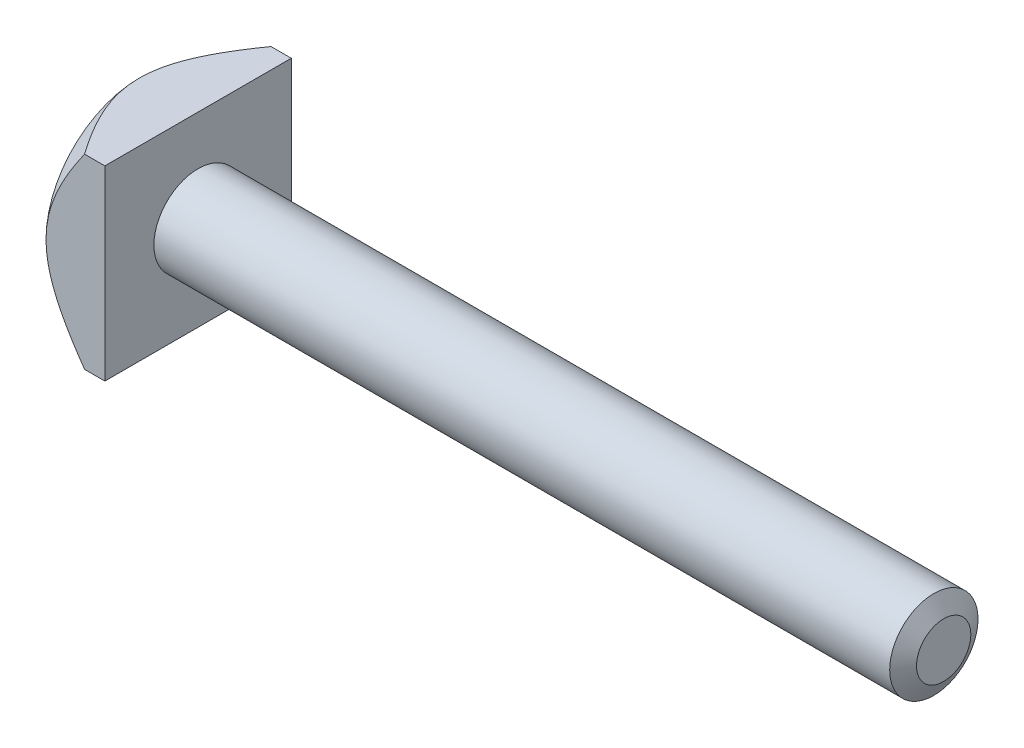
ISO-10303-21;
HEADER;
FILE_DESCRIPTION(('STEP AP214'),'2;1');
FILE_NAME('part.step','',(''),(''),'','','');
FILE_SCHEMA(('AUTOMOTIVE_DESIGN { 1 0 10303 214 1 1 1 1 }'));
ENDSEC;
DATA;
#1=APPLICATION_CONTEXT('core data for automotive mechanical design processes');
#2=APPLICATION_PROTOCOL_DEFINITION('international standard','automotive_design',2000,#1);
#3=PRODUCT_CONTEXT('',#1,'mechanical');
#4=PRODUCT('Part','Part','',(#3));
#5=PRODUCT_RELATED_PRODUCT_CATEGORY('part','',(#4));
#6=PRODUCT_DEFINITION_FORMATION('','',#4);
#7=PRODUCT_DEFINITION_CONTEXT('part definition',#1,'design');
#8=PRODUCT_DEFINITION('design','',#6,#7);
#9=PRODUCT_DEFINITION_SHAPE('','',#8);
#10=(LENGTH_UNIT() NAMED_UNIT(*) SI_UNIT(.MILLI.,.METRE.));
#11=(NAMED_UNIT(*) PLANE_ANGLE_UNIT() SI_UNIT($,.RADIAN.));
#12=(NAMED_UNIT(*) SI_UNIT($,.STERADIAN.) SOLID_ANGLE_UNIT());
#13=UNCERTAINTY_MEASURE_WITH_UNIT(LENGTH_MEASURE(1.E-05),#10,'distance_accuracy_value','');
#14=(GEOMETRIC_REPRESENTATION_CONTEXT(3) GLOBAL_UNCERTAINTY_ASSIGNED_CONTEXT((#13)) GLOBAL_UNIT_ASSIGNED_CONTEXT((#10,
#11,#12)) REPRESENTATION_CONTEXT('',''));
#15=CARTESIAN_POINT('',(0.,0.,0.));
#16=DIRECTION('',(0.,0.,1.));
#17=DIRECTION('',(1.,0.,0.));
#18=AXIS2_PLACEMENT_3D('',#15,#16,#17);
#19=CARTESIAN_POINT('',(6.,-9.5,-9.5));
#20=DIRECTION('',(0.,0.,1.));
#21=DIRECTION('',(1.,0.,0.));
#22=AXIS2_PLACEMENT_3D('',#19,#20,#21);
#23=PLANE('',#22);
#24=CARTESIAN_POINT('',(10.5397490442292,-17.6448729594658,-9.5));
#25=CARTESIAN_POINT('',(10.1740509318701,-17.2294676055011,-9.5));
#26=CARTESIAN_POINT('',(9.80991174790114,-16.8126750422406,-9.5));
#27=CARTESIAN_POINT('',(9.08559172525313,-15.9755726047441,-9.5));
#28=CARTESIAN_POINT('',(8.72541140450403,-15.5552622826643,-9.5));
#29=CARTESIAN_POINT('',(8.00801947670913,-14.7082154197354,-9.5));
#30=CARTESIAN_POINT('',(7.65083427703417,-14.2814564685435,-9.5));
#31=CARTESIAN_POINT('',(6.94271559775676,-13.4228138377135,-9.5));
#32=CARTESIAN_POINT('',(6.59178174995523,-12.9909304624125,-9.5));
#33=CARTESIAN_POINT('',(5.8743128996833,-12.0912432987366,-9.5));
#34=CARTESIAN_POINT('',(5.50833730294741,-11.6229922235265,-9.5));
#35=CARTESIAN_POINT('',(4.78836740631981,-10.6771626398532,-9.5));
#36=CARTESIAN_POINT('',(4.43437532177015,-10.1995824322098,-9.5));
#37=CARTESIAN_POINT('',(3.91621005156372,-9.47485811421282,-9.5));
#38=CARTESIAN_POINT('',(3.74580800216556,-9.23216576929913,-9.5));
#39=CARTESIAN_POINT('',(3.40990882744573,-8.74341552496572,-9.5));
#40=CARTESIAN_POINT('',(3.24441149623295,-8.4973577674554,-9.5));
#41=CARTESIAN_POINT('',(2.91929787257049,-8.00149883557695,-9.5));
#42=CARTESIAN_POINT('',(2.75967958679393,-7.75169897116564,-9.5));
#43=CARTESIAN_POINT('',(2.44743474137962,-7.24778048964867,-9.5));
#44=CARTESIAN_POINT('',(2.29480751803342,-6.99366228566542,-9.5));
#45=CARTESIAN_POINT('',(2.04522339487914,-6.56220358957074,-9.5));
#46=CARTESIAN_POINT('',(1.94600963059815,-6.38616986808012,-9.5));
#47=CARTESIAN_POINT('',(1.75206090702481,-6.03165627550383,-9.5));
#48=CARTESIAN_POINT('',(1.65732596256004,-5.85317639632244,-9.5));
#49=CARTESIAN_POINT('',(1.38070017793119,-5.31367662423799,-9.5));
#50=CARTESIAN_POINT('',(1.20643201571998,-4.94867097672205,-9.5));
#51=CARTESIAN_POINT('',(0.886108576513643,-4.21076575414403,-9.5));
#52=CARTESIAN_POINT('',(0.739784307822853,-3.83798426898276,-9.5));
#53=CARTESIAN_POINT('',(0.480763387059276,-3.08087037264878,-9.5));
#54=CARTESIAN_POINT('',(0.368046142838756,-2.69654519426552,-9.5));
#55=CARTESIAN_POINT('',(0.210747848496254,-2.03008107117148,-9.5));
#56=CARTESIAN_POINT('',(0.155893363904417,-1.75036893229043,-9.5));
#57=CARTESIAN_POINT('',(0.0698692499119896,-1.18730840218825,-9.5));
#58=CARTESIAN_POINT('',(0.0386952744121712,-0.90396068791846,-9.5));
#59=CARTESIAN_POINT('',(0.00172632293674425,-0.336061443519412,-9.5));
#60=CARTESIAN_POINT('',(-0.00411037424590556,-0.0515126652409154,-9.5));
#61=CARTESIAN_POINT('',(0.00981079382015773,0.516967754059431,-9.5));
#62=CARTESIAN_POINT('',(0.0295701744643975,0.800899357545015,-9.5));
#63=CARTESIAN_POINT('',(0.0934211464588457,1.36446402406409,-9.5));
#64=CARTESIAN_POINT('',(0.137385476267363,1.64411177293294,-9.5));
#65=CARTESIAN_POINT('',(0.247403094494964,2.19906763560613,-9.5));
#66=CARTESIAN_POINT('',(0.313462201425976,2.47437458627152,-9.5));
#67=CARTESIAN_POINT('',(0.427152134247497,2.8836854560526,-9.5));
#68=CARTESIAN_POINT('',(0.467566751486503,3.01975139817522,-9.5));
#69=CARTESIAN_POINT('',(0.552882708511166,3.290430579213,-9.5));
#70=CARTESIAN_POINT('',(0.597782724834646,3.42504423372742,-9.5));
#71=CARTESIAN_POINT('',(0.691719583446406,3.69281386852664,-9.5));
#72=CARTESIAN_POINT('',(0.740756385852614,3.82596986285051,-9.5));
#73=CARTESIAN_POINT('',(0.842628159451847,4.09082995385855,-9.5));
#74=CARTESIAN_POINT('',(0.895463521175358,4.22253389964735,-9.5));
#75=CARTESIAN_POINT('',(1.11435678587011,4.74797991836962,-9.5));
#76=CARTESIAN_POINT('',(1.29439342052333,5.13594827770292,-9.5));
#77=CARTESIAN_POINT('',(1.6781542588665,5.90003159028556,-9.5));
#78=CARTESIAN_POINT('',(1.8818929542083,6.27613911121163,-9.5));
#79=CARTESIAN_POINT('',(2.3077204819046,7.01890400837695,-9.5));
#80=CARTESIAN_POINT('',(2.52985058909013,7.38553756506628,-9.5));
#81=CARTESIAN_POINT('',(2.98774017142881,8.1100184666256,-9.5));
#82=CARTESIAN_POINT('',(3.22349676635058,8.46786764563242,-9.5));
#83=CARTESIAN_POINT('',(3.70893636287394,9.18124281183117,-9.5));
#84=CARTESIAN_POINT('',(3.9587671379424,9.5366677869467,-9.5));
#85=CARTESIAN_POINT('',(4.46696004063669,10.2413632395189,-9.5));
#86=CARTESIAN_POINT('',(4.72532251351163,10.5906334670343,-9.5));
#87=CARTESIAN_POINT('',(5.24845251639544,11.2835439956467,-9.5));
#88=CARTESIAN_POINT('',(5.51321033471839,11.6271916489512,-9.5));
#89=CARTESIAN_POINT('',(6.0481764433856,12.3101925404674,-9.5));
#90=CARTESIAN_POINT('',(6.31838457415177,12.6495459039384,-9.5));
#91=CARTESIAN_POINT('',(6.85643542198881,13.3161827975841,-9.5));
#92=CARTESIAN_POINT('',(7.12416765205754,13.6435556505652,-9.5));
#93=CARTESIAN_POINT('',(7.66316867385297,14.2953794758666,-9.5));
#94=CARTESIAN_POINT('',(7.93443750950853,14.6198304118084,-9.5));
#95=CARTESIAN_POINT('',(8.75270141640475,15.589480181523,-9.5));
#96=CARTESIAN_POINT('',(9.30412578404186,16.2309414124787,-9.5));
#97=CARTESIAN_POINT('',(10.4156274940732,17.5065643301639,-9.5));
#98=CARTESIAN_POINT('',(10.9757068909868,18.1407242193762,-9.5));
#99=CARTESIAN_POINT('',(12.1022492035901,19.4033084502766,-9.5));
#100=CARTESIAN_POINT('',(12.6687119352382,20.031732956384,-9.5));
#101=CARTESIAN_POINT('',(13.8073814418244,21.2850320273979,-9.5));
#102=CARTESIAN_POINT('',(14.3795954184628,21.9099000396876,-9.5));
#103=CARTESIAN_POINT('',(15.5278909806446,23.1560763269585,-9.5));
#104=CARTESIAN_POINT('',(16.1039725904302,23.7773845795819,-9.5));
#105=CARTESIAN_POINT('',(17.2591405695568,25.0170374371833,-9.5));
#106=CARTESIAN_POINT('',(17.8382265082941,25.6353824437012,-9.5));
#107=CARTESIAN_POINT('',(18.9989056120511,26.8697156271033,-9.5));
#108=CARTESIAN_POINT('',(19.5804987818215,27.4857037995175,-9.5));
#109=CARTESIAN_POINT('',(21.2207961007371,29.2172163496516,-9.5));
#110=CARTESIAN_POINT('',(22.2818533930034,30.3305112955609,-9.5));
#111=CARTESIAN_POINT('',(24.4088727622038,32.5524872239307,-9.5));
#112=CARTESIAN_POINT('',(25.4748350389504,33.6611680148589,-9.5));
#113=CARTESIAN_POINT('',(27.607849764915,35.8723738849253,-9.5));
#114=CARTESIAN_POINT('',(28.6748935327588,36.9749073415111,-9.5));
#115=CARTESIAN_POINT('',(30.2775176324379,38.6266560897581,-9.5));
#116=CARTESIAN_POINT('',(30.8120555521225,39.1768835757873,-9.5));
#117=CARTESIAN_POINT('',(31.881749504312,40.2767367608523,-9.5));
#118=CARTESIAN_POINT('',(32.4169055364405,40.8263624602541,-9.5));
#119=CARTESIAN_POINT('',(32.9523325814725,41.3757240614344,-9.5));
#120=B_SPLINE_CURVE_WITH_KNOTS('',3,(#24,#25,#26,#27,#28,#29,#30,#31,#32,#33,#34,#35,#36,#37,
#38,#39,#40,#41,#42,#43,#44,#45,#46,#47,#48,#49,#50,#51,#52,#53,#54,#55,#56,#57,#58,#59,#60,#61,
#62,#63,#64,#65,#66,#67,#68,#69,#70,#71,#72,#73,#74,#75,#76,#77,#78,#79,#80,#81,#82,#83,#84,#85,
#86,#87,#88,#89,#90,#91,#92,#93,#94,#95,#96,#97,#98,#99,#100,#101,#102,#103,#104,#105,#106,#107,
#108,#109,#110,#111,#112,#113,#114,#115,#116,#117,#118,#119),.UNSPECIFIED.,.F.,.F.,(4,2,2,2,2,2,
2,2,2,2,2,2,2,2,2,2,2,2,2,2,2,2,2,2,2,2,2,2,2,2,2,2,2,2,2,2,2,2,2,2,2,2,2,2,2,2,2,4),(0.,
1.66033511662324,3.32088492608776,4.99037103788057,6.65975849110603,8.44253771320777,
10.2256447302219,11.1152201121952,12.004758098373,12.8939916514495,13.7831406078993,
14.3892822557481,14.9954259101479,16.2079715914419,17.4081812091687,18.6076538998123,
19.4618901854153,20.3159696545732,21.1686422332649,22.021365296069,22.8696472572903,
23.7181527840139,24.143913273312,24.569548506671,24.9951796370199,25.4208545893226,
26.702729920288,27.9853931616287,29.2710173793666,30.5563708414144,31.8595466455747,
33.1627752496567,34.4641358357129,35.765458374762,37.0341613210163,38.3028800411185,
40.8404511025107,43.3786340754847,45.9167440549316,48.4585738777951,51.0004196476015,
53.5419106459616,56.0834064620603,60.6972117316324,65.3112066460323,69.914183829187,
72.2155590820646,74.5169329344517),.UNSPECIFIED.);
#121=CARTESIAN_POINT('',(3.93502884254439,9.5,-9.5));
#122=VERTEX_POINT('',#121);
#123=CARTESIAN_POINT('',(0.,0.,-9.5));
#124=VERTEX_POINT('',#123);
#125=EDGE_CURVE('E100',#122,#124,#120,.F.);
#126=ORIENTED_EDGE('',*,*,#125,.F.);
#127=DIRECTION('',(-1.,0.,0.));
#128=VECTOR('',#127,1.);
#129=CARTESIAN_POINT('',(6.,9.5,-9.5));
#130=LINE('',#129,#128);
#131=CARTESIAN_POINT('',(6.,9.5,-9.5));
#132=VERTEX_POINT('',#131);
#133=EDGE_CURVE('E108',#132,#122,#130,.T.);
#134=ORIENTED_EDGE('',*,*,#133,.F.);
#135=DIRECTION('',(0.,1.,0.));
#136=VECTOR('',#135,1.);
#137=CARTESIAN_POINT('',(6.,-9.5,-9.5));
#138=LINE('',#137,#136);
#139=CARTESIAN_POINT('',(6.,-9.5,-9.5));
#140=VERTEX_POINT('',#139);
#141=EDGE_CURVE('E94',#140,#132,#138,.T.);
#142=ORIENTED_EDGE('',*,*,#141,.F.);
#143=DIRECTION('',(-1.,0.,0.));
#144=VECTOR('',#143,1.);
#145=CARTESIAN_POINT('',(6.,-9.5,-9.5));
#146=LINE('',#145,#144);
#147=CARTESIAN_POINT('',(3.93502884254439,-9.5,-9.5));
#148=VERTEX_POINT('',#147);
#149=EDGE_CURVE('E190',#140,#148,#146,.T.);
#150=ORIENTED_EDGE('',*,*,#149,.T.);
#151=EDGE_CURVE('E118',#124,#148,#120,.F.);
#152=ORIENTED_EDGE('',*,*,#151,.F.);
#153=EDGE_LOOP('',(#126,#134,#142,#150,#152));
#154=FACE_BOUND('',#153,.T.);
#155=ADVANCED_FACE('F33',(#154),#23,.F.);
#156=CARTESIAN_POINT('',(6.,9.5,9.5));
#157=DIRECTION('',(0.,-1.,0.));
#158=DIRECTION('',(0.,0.,-1.));
#159=AXIS2_PLACEMENT_3D('',#156,#157,#158);
#160=PLANE('',#159);
#161=CARTESIAN_POINT('',(10.5397490442292,9.5,-17.6448729594658));
#162=CARTESIAN_POINT('',(10.1740509318701,9.5,-17.2294676055011));
#163=CARTESIAN_POINT('',(9.80991174790114,9.5,-16.8126750422406));
#164=CARTESIAN_POINT('',(9.08559172525313,9.5,-15.9755726047441));
#165=CARTESIAN_POINT('',(8.72541140450404,9.5,-15.5552622826643));
#166=CARTESIAN_POINT('',(8.00801947670913,9.5,-14.7082154197354));
#167=CARTESIAN_POINT('',(7.65083427703417,9.5,-14.2814564685435));
#168=CARTESIAN_POINT('',(6.94271559775677,9.5,-13.4228138377135));
#169=CARTESIAN_POINT('',(6.59178174995523,9.5,-12.9909304624125));
#170=CARTESIAN_POINT('',(5.8743128996833,9.5,-12.0912432987366));
#171=CARTESIAN_POINT('',(5.50833730294741,9.5,-11.6229922235265));
#172=CARTESIAN_POINT('',(4.78836740631981,9.5,-10.6771626398532));
#173=CARTESIAN_POINT('',(4.43437532177015,9.5,-10.1995824322098));
#174=CARTESIAN_POINT('',(3.91621005156372,9.5,-9.47485811421282));
#175=CARTESIAN_POINT('',(3.74580800216556,9.5,-9.23216576929913));
#176=CARTESIAN_POINT('',(3.40990882744573,9.5,-8.74341552496572));
#177=CARTESIAN_POINT('',(3.24441149623295,9.5,-8.4973577674554));
#178=CARTESIAN_POINT('',(2.91929787257049,9.5,-8.00149883557695));
#179=CARTESIAN_POINT('',(2.75967958679393,9.5,-7.75169897116564));
#180=CARTESIAN_POINT('',(2.44743474137963,9.5,-7.24778048964867));
#181=CARTESIAN_POINT('',(2.29480751803343,9.5,-6.99366228566542));
#182=CARTESIAN_POINT('',(2.04522339487915,9.5,-6.56220358957073));
#183=CARTESIAN_POINT('',(1.94600963059815,9.5,-6.38616986808012));
#184=CARTESIAN_POINT('',(1.75206090702482,9.5,-6.03165627550383));
#185=CARTESIAN_POINT('',(1.65732596256004,9.5,-5.85317639632244));
#186=CARTESIAN_POINT('',(1.38070017793119,9.5,-5.31367662423799));
#187=CARTESIAN_POINT('',(1.20643201571998,9.5,-4.94867097672205));
#188=CARTESIAN_POINT('',(0.886108576513645,9.5,-4.21076575414403));
#189=CARTESIAN_POINT('',(0.739784307822856,9.5,-3.83798426898276));
#190=CARTESIAN_POINT('',(0.480763387059279,9.5,-3.08087037264878));
#191=CARTESIAN_POINT('',(0.368046142838758,9.5,-2.69654519426552));
#192=CARTESIAN_POINT('',(0.210747848496256,9.5,-2.03008107117147));
#193=CARTESIAN_POINT('',(0.15589336390442,9.5,-1.75036893229043));
#194=CARTESIAN_POINT('',(0.0698692499119934,9.5,-1.18730840218825));
#195=CARTESIAN_POINT('',(0.0386952744121749,9.5,-0.903960687918458));
#196=CARTESIAN_POINT('',(0.00172632293674759,9.5,-0.336061443519411));
#197=CARTESIAN_POINT('',(-0.00411037424590237,9.5,-0.0515126652409146));
#198=CARTESIAN_POINT('',(0.00981079382016154,9.5,0.516967754059434));
#199=CARTESIAN_POINT('',(0.0295701744644023,9.5,0.800899357545019));
#200=CARTESIAN_POINT('',(0.0934211464588513,9.5,1.3644640240641));
#201=CARTESIAN_POINT('',(0.137385476267368,9.5,1.64411177293294));
#202=CARTESIAN_POINT('',(0.247403094494969,9.5,2.19906763560613));
#203=CARTESIAN_POINT('',(0.313462201425981,9.5,2.47437458627153));
#204=CARTESIAN_POINT('',(0.427152134247502,9.5,2.88368545605261));
#205=CARTESIAN_POINT('',(0.467566751486509,9.5,3.01975139817524));
#206=CARTESIAN_POINT('',(0.552882708511173,9.5,3.29043057921302));
#207=CARTESIAN_POINT('',(0.597782724834653,9.5,3.42504423372743));
#208=CARTESIAN_POINT('',(0.691719583446412,9.5,3.69281386852664));
#209=CARTESIAN_POINT('',(0.74075638585262,9.5,3.82596986285052));
#210=CARTESIAN_POINT('',(0.842628159451852,9.5,4.09082995385856));
#211=CARTESIAN_POINT('',(0.895463521175364,9.5,4.22253389964736));
#212=CARTESIAN_POINT('',(1.11435678587012,9.5,4.74797991836963));
#213=CARTESIAN_POINT('',(1.29439342052334,9.5,5.13594827770293));
#214=CARTESIAN_POINT('',(1.67815425886651,9.5,5.90003159028557));
#215=CARTESIAN_POINT('',(1.88189295420831,9.5,6.27613911121164));
#216=CARTESIAN_POINT('',(2.30772048190461,9.5,7.01890400837697));
#217=CARTESIAN_POINT('',(2.52985058909015,9.5,7.3855375650663));
#218=CARTESIAN_POINT('',(2.98774017142882,9.5,8.11001846662563));
#219=CARTESIAN_POINT('',(3.2234967663506,9.5,8.46786764563244));
#220=CARTESIAN_POINT('',(3.70893636287396,9.5,9.1812428118312));
#221=CARTESIAN_POINT('',(3.95876713794242,9.5,9.53666778694673));
#222=CARTESIAN_POINT('',(4.46696004063671,9.5,10.2413632395189));
#223=CARTESIAN_POINT('',(4.72532251351166,9.5,10.5906334670343));
#224=CARTESIAN_POINT('',(5.24845251639546,9.5,11.2835439956468));
#225=CARTESIAN_POINT('',(5.51321033471841,9.5,11.6271916489512));
#226=CARTESIAN_POINT('',(6.04817644338563,9.5,12.3101925404674));
#227=CARTESIAN_POINT('',(6.3183845741518,9.5,12.6495459039384));
#228=CARTESIAN_POINT('',(6.85643542198884,9.5,13.3161827975841));
#229=CARTESIAN_POINT('',(7.12416765205757,9.5,13.6435556505652));
#230=CARTESIAN_POINT('',(7.663168673853,9.5,14.2953794758666));
#231=CARTESIAN_POINT('',(7.93443750950856,9.5,14.6198304118084));
#232=CARTESIAN_POINT('',(8.75270141640478,9.5,15.589480181523));
#233=CARTESIAN_POINT('',(9.30412578404189,9.5,16.2309414124787));
#234=CARTESIAN_POINT('',(10.4156274940732,9.5,17.5065643301639));
#235=CARTESIAN_POINT('',(10.9757068909868,9.5,18.1407242193763));
#236=CARTESIAN_POINT('',(12.1022492035901,9.5,19.4033084502766));
#237=CARTESIAN_POINT('',(12.6687119352383,9.5,20.031732956384));
#238=CARTESIAN_POINT('',(13.8073814418244,9.5,21.2850320273979));
#239=CARTESIAN_POINT('',(14.3795954184628,9.5,21.9099000396876));
#240=CARTESIAN_POINT('',(15.5278909806446,9.5,23.1560763269585));
#241=CARTESIAN_POINT('',(16.1039725904302,9.5,23.7773845795819));
#242=CARTESIAN_POINT('',(17.2591405695568,9.5,25.0170374371833));
#243=CARTESIAN_POINT('',(17.8382265082941,9.5,25.6353824437013));
#244=CARTESIAN_POINT('',(18.9989056120512,9.5,26.8697156271033));
#245=CARTESIAN_POINT('',(19.5804987818216,9.5,27.4857037995175));
#246=CARTESIAN_POINT('',(21.2207961007371,9.5,29.2172163496516));
#247=CARTESIAN_POINT('',(22.2818533930034,9.5,30.3305112955609));
#248=CARTESIAN_POINT('',(24.4088727622038,9.5,32.5524872239307));
#249=CARTESIAN_POINT('',(25.4748350389504,9.5,33.661168014859));
#250=CARTESIAN_POINT('',(27.607849764915,9.5,35.8723738849254));
#251=CARTESIAN_POINT('',(28.6748935327588,9.5,36.9749073415111));
#252=CARTESIAN_POINT('',(30.277517632438,9.5,38.6266560897582));
#253=CARTESIAN_POINT('',(30.8120555521225,9.5,39.1768835757873));
#254=CARTESIAN_POINT('',(31.881749504312,9.5,40.2767367608523));
#255=CARTESIAN_POINT('',(32.4169055364406,9.5,40.8263624602542));
#256=CARTESIAN_POINT('',(32.9523325814725,9.5,41.3757240614344));
#257=B_SPLINE_CURVE_WITH_KNOTS('',3,(#161,#162,#163,#164,#165,#166,#167,#168,#169,#170,#171,
#172,#173,#174,#175,#176,#177,#178,#179,#180,#181,#182,#183,#184,#185,#186,#187,#188,#189,#190,
#191,#192,#193,#194,#195,#196,#197,#198,#199,#200,#201,#202,#203,#204,#205,#206,#207,#208,#209,
#210,#211,#212,#213,#214,#215,#216,#217,#218,#219,#220,#221,#222,#223,#224,#225,#226,#227,#228,
#229,#230,#231,#232,#233,#234,#235,#236,#237,#238,#239,#240,#241,#242,#243,#244,#245,#246,#247,
#248,#249,#250,#251,#252,#253,#254,#255,#256),.UNSPECIFIED.,.F.,.F.,(4,2,2,2,2,2,2,2,2,2,2,2,2,
2,2,2,2,2,2,2,2,2,2,2,2,2,2,2,2,2,2,2,2,2,2,2,2,2,2,2,2,2,2,2,2,2,2,4),(0.,1.66033511662324,
3.32088492608776,4.99037103788057,6.65975849110603,8.44253771320777,10.2256447302219,
11.1152201121952,12.004758098373,12.8939916514495,13.7831406078993,14.3892822557481,
14.9954259101479,16.2079715914419,17.4081812091687,18.6076538998123,19.4618901854153,
20.3159696545732,21.1686422332649,22.021365296069,22.8696472572903,23.7181527840139,
24.143913273312,24.569548506671,24.9951796370199,25.4208545893227,26.702729920288,
27.9853931616288,29.2710173793666,30.5563708414144,31.8595466455748,33.1627752496568,
34.464135835713,35.7654583747621,37.0341613210164,38.3028800411185,40.8404511025107,
43.3786340754848,45.9167440549317,48.4585738777952,51.0004196476015,53.5419106459616,
56.0834064620603,60.6972117316325,65.3112066460324,69.914183829187,72.2155590820647,
74.5169329344518),.UNSPECIFIED.);
#258=CARTESIAN_POINT('',(3.93502884254439,9.5,9.5));
#259=VERTEX_POINT('',#258);
#260=CARTESIAN_POINT('',(0.,9.5,0.));
#261=VERTEX_POINT('',#260);
#262=EDGE_CURVE('E85',#259,#261,#257,.F.);
#263=ORIENTED_EDGE('',*,*,#262,.F.);
#264=DIRECTION('',(-1.,0.,0.));
#265=VECTOR('',#264,1.);
#266=CARTESIAN_POINT('',(6.,9.5,9.5));
#267=LINE('',#266,#265);
#268=CARTESIAN_POINT('',(6.,9.5,9.5));
#269=VERTEX_POINT('',#268);
#270=EDGE_CURVE('E185',#269,#259,#267,.T.);
#271=ORIENTED_EDGE('',*,*,#270,.F.);
#272=DIRECTION('',(0.,0.,1.));
#273=VECTOR('',#272,1.);
#274=CARTESIAN_POINT('',(6.,9.5,9.5));
#275=LINE('',#274,#273);
#276=EDGE_CURVE('E195',#132,#269,#275,.T.);
#277=ORIENTED_EDGE('',*,*,#276,.F.);
#278=ORIENTED_EDGE('',*,*,#133,.T.);
#279=EDGE_CURVE('E95',#261,#122,#257,.F.);
#280=ORIENTED_EDGE('',*,*,#279,.F.);
#281=EDGE_LOOP('',(#263,#271,#277,#278,#280));
#282=FACE_BOUND('',#281,.T.);
#283=ADVANCED_FACE('F106',(#282),#160,.F.);
#284=CARTESIAN_POINT('',(6.,-9.5,9.5));
#285=DIRECTION('',(0.,0.,-1.));
#286=DIRECTION('',(-1.,0.,0.));
#287=AXIS2_PLACEMENT_3D('',#284,#285,#286);
#288=PLANE('',#287);
#289=CARTESIAN_POINT('',(10.5397490442292,-17.6448729594658,9.5));
#290=CARTESIAN_POINT('',(10.1740509318701,-17.2294676055011,9.5));
#291=CARTESIAN_POINT('',(9.80991174790114,-16.8126750422406,9.5));
#292=CARTESIAN_POINT('',(9.08559172525313,-15.9755726047441,9.5));
#293=CARTESIAN_POINT('',(8.72541140450404,-15.5552622826643,9.5));
#294=CARTESIAN_POINT('',(8.00801947670913,-14.7082154197354,9.5));
#295=CARTESIAN_POINT('',(7.65083427703417,-14.2814564685435,9.5));
#296=CARTESIAN_POINT('',(6.94271559775677,-13.4228138377135,9.5));
#297=CARTESIAN_POINT('',(6.59178174995523,-12.9909304624125,9.5));
#298=CARTESIAN_POINT('',(5.8743128996833,-12.0912432987366,9.5));
#299=CARTESIAN_POINT('',(5.50833730294741,-11.6229922235265,9.5));
#300=CARTESIAN_POINT('',(4.78836740631981,-10.6771626398532,9.5));
#301=CARTESIAN_POINT('',(4.43437532177015,-10.1995824322098,9.5));
#302=CARTESIAN_POINT('',(3.91621005156372,-9.47485811421282,9.5));
#303=CARTESIAN_POINT('',(3.74580800216556,-9.23216576929913,9.5));
#304=CARTESIAN_POINT('',(3.40990882744573,-8.74341552496572,9.5));
#305=CARTESIAN_POINT('',(3.24441149623295,-8.4973577674554,9.5));
#306=CARTESIAN_POINT('',(2.91929787257049,-8.00149883557695,9.5));
#307=CARTESIAN_POINT('',(2.75967958679393,-7.75169897116564,9.5));
#308=CARTESIAN_POINT('',(2.44743474137963,-7.24778048964867,9.5));
#309=CARTESIAN_POINT('',(2.29480751803343,-6.99366228566542,9.5));
#310=CARTESIAN_POINT('',(2.04522339487915,-6.56220358957073,9.5));
#311=CARTESIAN_POINT('',(1.94600963059815,-6.38616986808012,9.5));
#312=CARTESIAN_POINT('',(1.75206090702482,-6.03165627550383,9.5));
#313=CARTESIAN_POINT('',(1.65732596256004,-5.85317639632244,9.5));
#314=CARTESIAN_POINT('',(1.38070017793119,-5.31367662423799,9.5));
#315=CARTESIAN_POINT('',(1.20643201571998,-4.94867097672205,9.5));
#316=CARTESIAN_POINT('',(0.886108576513645,-4.21076575414403,9.5));
#317=CARTESIAN_POINT('',(0.739784307822856,-3.83798426898276,9.5));
#318=CARTESIAN_POINT('',(0.480763387059279,-3.08087037264878,9.5));
#319=CARTESIAN_POINT('',(0.368046142838758,-2.69654519426552,9.5));
#320=CARTESIAN_POINT('',(0.210747848496256,-2.03008107117147,9.5));
#321=CARTESIAN_POINT('',(0.15589336390442,-1.75036893229043,9.5));
#322=CARTESIAN_POINT('',(0.0698692499119934,-1.18730840218825,9.5));
#323=CARTESIAN_POINT('',(0.0386952744121749,-0.903960687918458,9.5));
#324=CARTESIAN_POINT('',(0.00172632293674759,-0.336061443519411,9.5));
#325=CARTESIAN_POINT('',(-0.00411037424590237,-0.0515126652409146,9.5));
#326=CARTESIAN_POINT('',(0.00981079382016154,0.516967754059434,9.5));
#327=CARTESIAN_POINT('',(0.0295701744644023,0.800899357545019,9.5));
#328=CARTESIAN_POINT('',(0.0934211464588513,1.3644640240641,9.5));
#329=CARTESIAN_POINT('',(0.137385476267368,1.64411177293294,9.5));
#330=CARTESIAN_POINT('',(0.247403094494969,2.19906763560613,9.5));
#331=CARTESIAN_POINT('',(0.313462201425981,2.47437458627153,9.5));
#332=CARTESIAN_POINT('',(0.427152134247502,2.88368545605261,9.5));
#333=CARTESIAN_POINT('',(0.467566751486509,3.01975139817524,9.5));
#334=CARTESIAN_POINT('',(0.552882708511173,3.29043057921302,9.5));
#335=CARTESIAN_POINT('',(0.597782724834653,3.42504423372743,9.5));
#336=CARTESIAN_POINT('',(0.691719583446412,3.69281386852664,9.5));
#337=CARTESIAN_POINT('',(0.74075638585262,3.82596986285052,9.5));
#338=CARTESIAN_POINT('',(0.842628159451852,4.09082995385856,9.5));
#339=CARTESIAN_POINT('',(0.895463521175364,4.22253389964736,9.5));
#340=CARTESIAN_POINT('',(1.11435678587012,4.74797991836963,9.5));
#341=CARTESIAN_POINT('',(1.29439342052334,5.13594827770293,9.5));
#342=CARTESIAN_POINT('',(1.67815425886651,5.90003159028557,9.5));
#343=CARTESIAN_POINT('',(1.88189295420831,6.27613911121164,9.5));
#344=CARTESIAN_POINT('',(2.30772048190461,7.01890400837697,9.5));
#345=CARTESIAN_POINT('',(2.52985058909015,7.3855375650663,9.5));
#346=CARTESIAN_POINT('',(2.98774017142882,8.11001846662563,9.5));
#347=CARTESIAN_POINT('',(3.2234967663506,8.46786764563244,9.5));
#348=CARTESIAN_POINT('',(3.70893636287396,9.1812428118312,9.5));
#349=CARTESIAN_POINT('',(3.95876713794242,9.53666778694673,9.5));
#350=CARTESIAN_POINT('',(4.46696004063671,10.2413632395189,9.5));
#351=CARTESIAN_POINT('',(4.72532251351166,10.5906334670343,9.5));
#352=CARTESIAN_POINT('',(5.24845251639546,11.2835439956468,9.5));
#353=CARTESIAN_POINT('',(5.51321033471841,11.6271916489512,9.5));
#354=CARTESIAN_POINT('',(6.04817644338563,12.3101925404674,9.5));
#355=CARTESIAN_POINT('',(6.3183845741518,12.6495459039384,9.5));
#356=CARTESIAN_POINT('',(6.85643542198884,13.3161827975841,9.5));
#357=CARTESIAN_POINT('',(7.12416765205757,13.6435556505652,9.5));
#358=CARTESIAN_POINT('',(7.663168673853,14.2953794758666,9.5));
#359=CARTESIAN_POINT('',(7.93443750950856,14.6198304118084,9.5));
#360=CARTESIAN_POINT('',(8.75270141640478,15.589480181523,9.5));
#361=CARTESIAN_POINT('',(9.30412578404189,16.2309414124787,9.5));
#362=CARTESIAN_POINT('',(10.4156274940732,17.5065643301639,9.5));
#363=CARTESIAN_POINT('',(10.9757068909868,18.1407242193763,9.5));
#364=CARTESIAN_POINT('',(12.1022492035901,19.4033084502766,9.5));
#365=CARTESIAN_POINT('',(12.6687119352383,20.031732956384,9.5));
#366=CARTESIAN_POINT('',(13.8073814418244,21.2850320273979,9.5));
#367=CARTESIAN_POINT('',(14.3795954184628,21.9099000396876,9.5));
#368=CARTESIAN_POINT('',(15.5278909806446,23.1560763269585,9.5));
#369=CARTESIAN_POINT('',(16.1039725904302,23.7773845795819,9.5));
#370=CARTESIAN_POINT('',(17.2591405695568,25.0170374371833,9.5));
#371=CARTESIAN_POINT('',(17.8382265082941,25.6353824437013,9.5));
#372=CARTESIAN_POINT('',(18.9989056120512,26.8697156271033,9.5));
#373=CARTESIAN_POINT('',(19.5804987818216,27.4857037995175,9.5));
#374=CARTESIAN_POINT('',(21.2207961007371,29.2172163496516,9.5));
#375=CARTESIAN_POINT('',(22.2818533930034,30.3305112955609,9.5));
#376=CARTESIAN_POINT('',(24.4088727622038,32.5524872239307,9.5));
#377=CARTESIAN_POINT('',(25.4748350389504,33.661168014859,9.5));
#378=CARTESIAN_POINT('',(27.607849764915,35.8723738849254,9.5));
#379=CARTESIAN_POINT('',(28.6748935327588,36.9749073415111,9.5));
#380=CARTESIAN_POINT('',(30.277517632438,38.6266560897582,9.5));
#381=CARTESIAN_POINT('',(30.8120555521225,39.1768835757873,9.5));
#382=CARTESIAN_POINT('',(31.881749504312,40.2767367608523,9.5));
#383=CARTESIAN_POINT('',(32.4169055364406,40.8263624602542,9.5));
#384=CARTESIAN_POINT('',(32.9523325814725,41.3757240614344,9.5));
#385=B_SPLINE_CURVE_WITH_KNOTS('',3,(#289,#290,#291,#292,#293,#294,#295,#296,#297,#298,#299,
#300,#301,#302,#303,#304,#305,#306,#307,#308,#309,#310,#311,#312,#313,#314,#315,#316,#317,#318,
#319,#320,#321,#322,#323,#324,#325,#326,#327,#328,#329,#330,#331,#332,#333,#334,#335,#336,#337,
#338,#339,#340,#341,#342,#343,#344,#345,#346,#347,#348,#349,#350,#351,#352,#353,#354,#355,#356,
#357,#358,#359,#360,#361,#362,#363,#364,#365,#366,#367,#368,#369,#370,#371,#372,#373,#374,#375,
#376,#377,#378,#379,#380,#381,#382,#383,#384),.UNSPECIFIED.,.F.,.F.,(4,2,2,2,2,2,2,2,2,2,2,2,2,
2,2,2,2,2,2,2,2,2,2,2,2,2,2,2,2,2,2,2,2,2,2,2,2,2,2,2,2,2,2,2,2,2,2,4),(0.,1.66033511662324,
3.32088492608776,4.99037103788057,6.65975849110603,8.44253771320777,10.2256447302219,
11.1152201121952,12.004758098373,12.8939916514495,13.7831406078993,14.3892822557481,
14.9954259101479,16.2079715914419,17.4081812091687,18.6076538998123,19.4618901854153,
20.3159696545732,21.1686422332649,22.021365296069,22.8696472572903,23.7181527840139,
24.143913273312,24.569548506671,24.9951796370199,25.4208545893227,26.702729920288,
27.9853931616288,29.2710173793666,30.5563708414144,31.8595466455748,33.1627752496568,
34.464135835713,35.7654583747621,37.0341613210164,38.3028800411185,40.8404511025107,
43.3786340754848,45.9167440549317,48.4585738777952,51.0004196476015,53.5419106459616,
56.0834064620603,60.6972117316325,65.3112066460324,69.914183829187,72.2155590820647,
74.5169329344518),.UNSPECIFIED.);
#386=CARTESIAN_POINT('',(3.93502884254439,-9.5,9.5));
#387=VERTEX_POINT('',#386);
#388=CARTESIAN_POINT('',(0.,0.,9.5));
#389=VERTEX_POINT('',#388);
#390=EDGE_CURVE('E110',#387,#389,#385,.T.);
#391=ORIENTED_EDGE('',*,*,#390,.F.);
#392=DIRECTION('',(-1.,0.,0.));
#393=VECTOR('',#392,1.);
#394=CARTESIAN_POINT('',(6.,-9.5,9.5));
#395=LINE('',#394,#393);
#396=CARTESIAN_POINT('',(6.,-9.5,9.5));
#397=VERTEX_POINT('',#396);
#398=EDGE_CURVE('E187',#397,#387,#395,.T.);
#399=ORIENTED_EDGE('',*,*,#398,.F.);
#400=DIRECTION('',(0.,-1.,0.));
#401=VECTOR('',#400,1.);
#402=CARTESIAN_POINT('',(6.,-9.5,9.5));
#403=LINE('',#402,#401);
#404=EDGE_CURVE('E194',#269,#397,#403,.T.);
#405=ORIENTED_EDGE('',*,*,#404,.F.);
#406=ORIENTED_EDGE('',*,*,#270,.T.);
#407=EDGE_CURVE('E89',#389,#259,#385,.T.);
#408=ORIENTED_EDGE('',*,*,#407,.F.);
#409=EDGE_LOOP('',(#391,#399,#405,#406,#408));
#410=FACE_BOUND('',#409,.T.);
#411=ADVANCED_FACE('F128',(#410),#288,.F.);
#412=CARTESIAN_POINT('',(6.,-9.5,9.5));
#413=DIRECTION('',(0.,1.,0.));
#414=DIRECTION('',(0.,0.,1.));
#415=AXIS2_PLACEMENT_3D('',#412,#413,#414);
#416=PLANE('',#415);
#417=CARTESIAN_POINT('',(10.5397490442292,-9.5,-17.6448729594658));
#418=CARTESIAN_POINT('',(10.1740509318701,-9.5,-17.2294676055011));
#419=CARTESIAN_POINT('',(9.80991174790114,-9.5,-16.8126750422406));
#420=CARTESIAN_POINT('',(9.08559172525313,-9.5,-15.9755726047441));
#421=CARTESIAN_POINT('',(8.72541140450403,-9.5,-15.5552622826643));
#422=CARTESIAN_POINT('',(8.00801947670913,-9.5,-14.7082154197354));
#423=CARTESIAN_POINT('',(7.65083427703417,-9.5,-14.2814564685435));
#424=CARTESIAN_POINT('',(6.94271559775676,-9.5,-13.4228138377135));
#425=CARTESIAN_POINT('',(6.59178174995523,-9.5,-12.9909304624125));
#426=CARTESIAN_POINT('',(5.8743128996833,-9.5,-12.0912432987366));
#427=CARTESIAN_POINT('',(5.50833730294741,-9.5,-11.6229922235265));
#428=CARTESIAN_POINT('',(4.78836740631981,-9.5,-10.6771626398532));
#429=CARTESIAN_POINT('',(4.43437532177015,-9.5,-10.1995824322098));
#430=CARTESIAN_POINT('',(3.91621005156372,-9.5,-9.47485811421282));
#431=CARTESIAN_POINT('',(3.74580800216556,-9.5,-9.23216576929913));
#432=CARTESIAN_POINT('',(3.40990882744573,-9.5,-8.74341552496572));
#433=CARTESIAN_POINT('',(3.24441149623295,-9.5,-8.4973577674554));
#434=CARTESIAN_POINT('',(2.91929787257049,-9.5,-8.00149883557695));
#435=CARTESIAN_POINT('',(2.75967958679393,-9.5,-7.75169897116564));
#436=CARTESIAN_POINT('',(2.44743474137962,-9.5,-7.24778048964867));
#437=CARTESIAN_POINT('',(2.29480751803342,-9.5,-6.99366228566542));
#438=CARTESIAN_POINT('',(2.04522339487914,-9.5,-6.56220358957074));
#439=CARTESIAN_POINT('',(1.94600963059815,-9.5,-6.38616986808012));
#440=CARTESIAN_POINT('',(1.75206090702481,-9.5,-6.03165627550383));
#441=CARTESIAN_POINT('',(1.65732596256004,-9.5,-5.85317639632244));
#442=CARTESIAN_POINT('',(1.38070017793119,-9.5,-5.31367662423799));
#443=CARTESIAN_POINT('',(1.20643201571998,-9.5,-4.94867097672205));
#444=CARTESIAN_POINT('',(0.886108576513643,-9.5,-4.21076575414403));
#445=CARTESIAN_POINT('',(0.739784307822853,-9.5,-3.83798426898276));
#446=CARTESIAN_POINT('',(0.480763387059276,-9.5,-3.08087037264878));
#447=CARTESIAN_POINT('',(0.368046142838756,-9.5,-2.69654519426552));
#448=CARTESIAN_POINT('',(0.210747848496254,-9.5,-2.03008107117148));
#449=CARTESIAN_POINT('',(0.155893363904417,-9.5,-1.75036893229043));
#450=CARTESIAN_POINT('',(0.0698692499119896,-9.5,-1.18730840218825));
#451=CARTESIAN_POINT('',(0.0386952744121712,-9.5,-0.90396068791846));
#452=CARTESIAN_POINT('',(0.00172632293674425,-9.5,-0.336061443519412));
#453=CARTESIAN_POINT('',(-0.00411037424590556,-9.5,-0.0515126652409154));
#454=CARTESIAN_POINT('',(0.00981079382015773,-9.5,0.516967754059431));
#455=CARTESIAN_POINT('',(0.0295701744643975,-9.5,0.800899357545015));
#456=CARTESIAN_POINT('',(0.0934211464588457,-9.5,1.36446402406409));
#457=CARTESIAN_POINT('',(0.137385476267363,-9.5,1.64411177293294));
#458=CARTESIAN_POINT('',(0.247403094494964,-9.5,2.19906763560613));
#459=CARTESIAN_POINT('',(0.313462201425976,-9.5,2.47437458627152));
#460=CARTESIAN_POINT('',(0.427152134247497,-9.5,2.8836854560526));
#461=CARTESIAN_POINT('',(0.467566751486503,-9.5,3.01975139817522));
#462=CARTESIAN_POINT('',(0.552882708511166,-9.5,3.290430579213));
#463=CARTESIAN_POINT('',(0.597782724834646,-9.5,3.42504423372742));
#464=CARTESIAN_POINT('',(0.691719583446406,-9.5,3.69281386852664));
#465=CARTESIAN_POINT('',(0.740756385852614,-9.5,3.82596986285051));
#466=CARTESIAN_POINT('',(0.842628159451847,-9.5,4.09082995385855));
#467=CARTESIAN_POINT('',(0.895463521175358,-9.5,4.22253389964735));
#468=CARTESIAN_POINT('',(1.11435678587011,-9.5,4.74797991836962));
#469=CARTESIAN_POINT('',(1.29439342052333,-9.5,5.13594827770292));
#470=CARTESIAN_POINT('',(1.6781542588665,-9.5,5.90003159028556));
#471=CARTESIAN_POINT('',(1.8818929542083,-9.5,6.27613911121163));
#472=CARTESIAN_POINT('',(2.3077204819046,-9.5,7.01890400837695));
#473=CARTESIAN_POINT('',(2.52985058909013,-9.5,7.38553756506628));
#474=CARTESIAN_POINT('',(2.98774017142881,-9.5,8.1100184666256));
#475=CARTESIAN_POINT('',(3.22349676635058,-9.5,8.46786764563242));
#476=CARTESIAN_POINT('',(3.70893636287394,-9.5,9.18124281183117));
#477=CARTESIAN_POINT('',(3.9587671379424,-9.5,9.5366677869467));
#478=CARTESIAN_POINT('',(4.46696004063669,-9.5,10.2413632395189));
#479=CARTESIAN_POINT('',(4.72532251351163,-9.5,10.5906334670343));
#480=CARTESIAN_POINT('',(5.24845251639544,-9.5,11.2835439956467));
#481=CARTESIAN_POINT('',(5.51321033471839,-9.5,11.6271916489512));
#482=CARTESIAN_POINT('',(6.0481764433856,-9.5,12.3101925404674));
#483=CARTESIAN_POINT('',(6.31838457415177,-9.5,12.6495459039384));
#484=CARTESIAN_POINT('',(6.85643542198881,-9.5,13.3161827975841));
#485=CARTESIAN_POINT('',(7.12416765205754,-9.5,13.6435556505652));
#486=CARTESIAN_POINT('',(7.66316867385297,-9.5,14.2953794758666));
#487=CARTESIAN_POINT('',(7.93443750950853,-9.5,14.6198304118084));
#488=CARTESIAN_POINT('',(8.75270141640475,-9.5,15.589480181523));
#489=CARTESIAN_POINT('',(9.30412578404186,-9.5,16.2309414124787));
#490=CARTESIAN_POINT('',(10.4156274940732,-9.5,17.5065643301639));
#491=CARTESIAN_POINT('',(10.9757068909868,-9.5,18.1407242193762));
#492=CARTESIAN_POINT('',(12.1022492035901,-9.5,19.4033084502766));
#493=CARTESIAN_POINT('',(12.6687119352382,-9.5,20.031732956384));
#494=CARTESIAN_POINT('',(13.8073814418244,-9.5,21.2850320273979));
#495=CARTESIAN_POINT('',(14.3795954184628,-9.5,21.9099000396876));
#496=CARTESIAN_POINT('',(15.5278909806446,-9.5,23.1560763269585));
#497=CARTESIAN_POINT('',(16.1039725904302,-9.5,23.7773845795819));
#498=CARTESIAN_POINT('',(17.2591405695568,-9.5,25.0170374371833));
#499=CARTESIAN_POINT('',(17.8382265082941,-9.5,25.6353824437012));
#500=CARTESIAN_POINT('',(18.9989056120511,-9.5,26.8697156271033));
#501=CARTESIAN_POINT('',(19.5804987818215,-9.5,27.4857037995175));
#502=CARTESIAN_POINT('',(21.2207961007371,-9.5,29.2172163496516));
#503=CARTESIAN_POINT('',(22.2818533930034,-9.5,30.3305112955609));
#504=CARTESIAN_POINT('',(24.4088727622038,-9.5,32.5524872239307));
#505=CARTESIAN_POINT('',(25.4748350389504,-9.5,33.6611680148589));
#506=CARTESIAN_POINT('',(27.607849764915,-9.5,35.8723738849253));
#507=CARTESIAN_POINT('',(28.6748935327588,-9.5,36.9749073415111));
#508=CARTESIAN_POINT('',(30.2775176324379,-9.5,38.6266560897581));
#509=CARTESIAN_POINT('',(30.8120555521225,-9.5,39.1768835757873));
#510=CARTESIAN_POINT('',(31.881749504312,-9.5,40.2767367608523));
#511=CARTESIAN_POINT('',(32.4169055364405,-9.5,40.8263624602541));
#512=CARTESIAN_POINT('',(32.9523325814725,-9.5,41.3757240614344));
#513=B_SPLINE_CURVE_WITH_KNOTS('',3,(#417,#418,#419,#420,#421,#422,#423,#424,#425,#426,#427,
#428,#429,#430,#431,#432,#433,#434,#435,#436,#437,#438,#439,#440,#441,#442,#443,#444,#445,#446,
#447,#448,#449,#450,#451,#452,#453,#454,#455,#456,#457,#458,#459,#460,#461,#462,#463,#464,#465,
#466,#467,#468,#469,#470,#471,#472,#473,#474,#475,#476,#477,#478,#479,#480,#481,#482,#483,#484,
#485,#486,#487,#488,#489,#490,#491,#492,#493,#494,#495,#496,#497,#498,#499,#500,#501,#502,#503,
#504,#505,#506,#507,#508,#509,#510,#511,#512),.UNSPECIFIED.,.F.,.F.,(4,2,2,2,2,2,2,2,2,2,2,2,2,
2,2,2,2,2,2,2,2,2,2,2,2,2,2,2,2,2,2,2,2,2,2,2,2,2,2,2,2,2,2,2,2,2,2,4),(0.,1.66033511662324,
3.32088492608776,4.99037103788057,6.65975849110603,8.44253771320777,10.2256447302219,
11.1152201121952,12.004758098373,12.8939916514495,13.7831406078993,14.3892822557481,
14.9954259101479,16.2079715914419,17.4081812091687,18.6076538998123,19.4618901854153,
20.3159696545732,21.1686422332649,22.021365296069,22.8696472572903,23.7181527840139,
24.143913273312,24.569548506671,24.9951796370199,25.4208545893226,26.702729920288,
27.9853931616287,29.2710173793666,30.5563708414144,31.8595466455747,33.1627752496567,
34.4641358357129,35.765458374762,37.0341613210163,38.3028800411185,40.8404511025107,
43.3786340754847,45.9167440549316,48.4585738777951,51.0004196476015,53.5419106459616,
56.0834064620603,60.6972117316324,65.3112066460323,69.914183829187,72.2155590820646,
74.5169329344517),.UNSPECIFIED.);
#514=CARTESIAN_POINT('',(0.,-9.5,0.));
#515=VERTEX_POINT('',#514);
#516=EDGE_CURVE('E141',#148,#515,#513,.T.);
#517=ORIENTED_EDGE('',*,*,#516,.F.);
#518=ORIENTED_EDGE('',*,*,#149,.F.);
#519=DIRECTION('',(0.,0.,-1.));
#520=VECTOR('',#519,1.);
#521=CARTESIAN_POINT('',(6.,-9.5,9.5));
#522=LINE('',#521,#520);
#523=EDGE_CURVE('E192',#397,#140,#522,.T.);
#524=ORIENTED_EDGE('',*,*,#523,.F.);
#525=ORIENTED_EDGE('',*,*,#398,.T.);
#526=EDGE_CURVE('E103',#515,#387,#513,.T.);
#527=ORIENTED_EDGE('',*,*,#526,.F.);
#528=EDGE_LOOP('',(#517,#518,#524,#525,#527));
#529=FACE_BOUND('',#528,.T.);
#530=ADVANCED_FACE('F151',(#529),#416,.F.);
#531=CARTESIAN_POINT('',(6.,0.,0.));
#532=DIRECTION('',(-1.,0.,0.));
#533=DIRECTION('',(0.,0.,1.));
#534=AXIS2_PLACEMENT_3D('',#531,#532,#533);
#535=PLANE('',#534);
#536=CARTESIAN_POINT('',(6.00000000000001,0.,0.));
#537=DIRECTION('',(-1.,0.,0.));
#538=DIRECTION('',(0.,0.,1.));
#539=AXIS2_PLACEMENT_3D('',#536,#537,#538);
#540=CIRCLE('',#539,4.5);
#541=CARTESIAN_POINT('',(6.00000000000001,0.,4.5));
#542=VERTEX_POINT('',#541);
#543=EDGE_CURVE('E178',#542,#542,#540,.F.);
#544=ORIENTED_EDGE('',*,*,#543,.F.);
#545=EDGE_LOOP('',(#544));
#546=FACE_BOUND('',#545,.T.);
#547=ORIENTED_EDGE('',*,*,#141,.T.);
#548=ORIENTED_EDGE('',*,*,#276,.T.);
#549=ORIENTED_EDGE('',*,*,#404,.T.);
#550=ORIENTED_EDGE('',*,*,#523,.T.);
#551=EDGE_LOOP('',(#547,#548,#549,#550));
#552=FACE_BOUND('',#551,.T.);
#553=ADVANCED_FACE('F155',(#546,#552),#535,.F.);
#554=CARTESIAN_POINT('',(82.,0.,0.));
#555=DIRECTION('',(-1.,0.,0.));
#556=DIRECTION('',(0.,0.,1.));
#557=AXIS2_PLACEMENT_3D('',#554,#555,#556);
#558=CYLINDRICAL_SURFACE('',#557,4.5);
#559=CARTESIAN_POINT('',(81.,0.,0.));
#560=DIRECTION('',(1.,0.,0.));
#561=DIRECTION('',(0.,0.,-1.));
#562=AXIS2_PLACEMENT_3D('',#559,#560,#561);
#563=CIRCLE('',#562,4.5);
#564=CARTESIAN_POINT('',(81.,0.,-4.5));
#565=VERTEX_POINT('',#564);
#566=EDGE_CURVE('E177',#565,#565,#563,.F.);
#567=ORIENTED_EDGE('',*,*,#566,.T.);
#568=EDGE_LOOP('',(#567));
#569=FACE_BOUND('',#568,.T.);
#570=ORIENTED_EDGE('',*,*,#543,.T.);
#571=EDGE_LOOP('',(#570));
#572=FACE_BOUND('',#571,.T.);
#573=ADVANCED_FACE('F161',(#569,#572),#558,.T.);
#574=CARTESIAN_POINT('',(82.,0.,0.));
#575=DIRECTION('',(1.,0.,0.));
#576=DIRECTION('',(0.,0.,-1.));
#577=AXIS2_PLACEMENT_3D('',#574,#575,#576);
#578=PLANE('',#577);
#579=CARTESIAN_POINT('',(82.,0.,0.));
#580=DIRECTION('',(1.,0.,0.));
#581=DIRECTION('',(0.,0.,-1.));
#582=AXIS2_PLACEMENT_3D('',#579,#580,#581);
#583=CIRCLE('',#582,2.76794919243112);
#584=CARTESIAN_POINT('',(82.,0.,-2.76794919243112));
#585=VERTEX_POINT('',#584);
#586=EDGE_CURVE('E175',#585,#585,#583,.T.);
#587=ORIENTED_EDGE('',*,*,#586,.T.);
#588=EDGE_LOOP('',(#587));
#589=FACE_BOUND('',#588,.T.);
#590=ADVANCED_FACE('F164',(#589),#578,.T.);
#591=CARTESIAN_POINT('',(82.,0.,0.));
#592=DIRECTION('',(-1.,0.,0.));
#593=DIRECTION('',(0.,0.,1.));
#594=AXIS2_PLACEMENT_3D('',#591,#592,#593);
#595=CONICAL_SURFACE('',#594,2.76794919243112,1.04719755119659);
#596=ORIENTED_EDGE('',*,*,#566,.F.);
#597=EDGE_LOOP('',(#596));
#598=FACE_BOUND('',#597,.T.);
#599=ORIENTED_EDGE('',*,*,#586,.F.);
#600=EDGE_LOOP('',(#599));
#601=FACE_BOUND('',#600,.T.);
#602=ADVANCED_FACE('F35',(#598,#601),#595,.T.);
#603=CARTESIAN_POINT('',(0.,0.,0.));
#604=DIRECTION('',(1.,0.,0.));
#605=DIRECTION('',(0.,0.,1.));
#606=AXIS2_PLACEMENT_3D('',#603,#604,#605);
#607=CONICAL_SURFACE('',#606,9.5,0.78539816339745);
#608=ORIENTED_EDGE('',*,*,#390,.T.);
#609=CARTESIAN_POINT('',(0.,0.,0.));
#610=DIRECTION('',(-1.,0.,0.));
#611=DIRECTION('',(0.,0.,1.));
#612=AXIS2_PLACEMENT_3D('',#609,#610,#611);
#613=CIRCLE('',#612,9.5);
#614=EDGE_CURVE('E37',#515,#389,#613,.T.);
#615=ORIENTED_EDGE('',*,*,#614,.F.);
#616=ORIENTED_EDGE('',*,*,#526,.T.);
#617=EDGE_LOOP('',(#608,#615,#616));
#618=FACE_BOUND('',#617,.T.);
#619=ADVANCED_FACE('F171',(#618),#607,.T.);
#620=ORIENTED_EDGE('',*,*,#151,.T.);
#621=ORIENTED_EDGE('',*,*,#516,.T.);
#622=EDGE_CURVE('E42',#124,#515,#613,.T.);
#623=ORIENTED_EDGE('',*,*,#622,.F.);
#624=EDGE_LOOP('',(#620,#621,#623));
#625=FACE_BOUND('',#624,.T.);
#626=ADVANCED_FACE('F201',(#625),#607,.T.);
#627=ORIENTED_EDGE('',*,*,#279,.T.);
#628=ORIENTED_EDGE('',*,*,#125,.T.);
#629=EDGE_CURVE('E12',#261,#124,#613,.T.);
#630=ORIENTED_EDGE('',*,*,#629,.F.);
#631=EDGE_LOOP('',(#627,#628,#630));
#632=FACE_BOUND('',#631,.T.);
#633=ADVANCED_FACE('F98',(#632),#607,.T.);
#634=ORIENTED_EDGE('',*,*,#262,.T.);
#635=CARTESIAN_POINT('',(0.,0.,0.));
#636=DIRECTION('',(-1.,0.,0.));
#637=DIRECTION('',(0.,0.,1.));
#638=AXIS2_PLACEMENT_3D('',#635,#636,#637);
#639=CIRCLE('',#638,9.5);
#640=EDGE_CURVE('E49',#389,#261,#639,.T.);
#641=ORIENTED_EDGE('',*,*,#640,.F.);
#642=ORIENTED_EDGE('',*,*,#407,.T.);
#643=EDGE_LOOP('',(#634,#641,#642));
#644=FACE_BOUND('',#643,.T.);
#645=ADVANCED_FACE('F87',(#644),#607,.T.);
#646=CARTESIAN_POINT('',(0.,0.,0.));
#647=DIRECTION('',(-1.,0.,0.));
#648=DIRECTION('',(0.,0.,1.));
#649=AXIS2_PLACEMENT_3D('',#646,#647,#648);
#650=PLANE('',#649);
#651=ORIENTED_EDGE('',*,*,#614,.T.);
#652=ORIENTED_EDGE('',*,*,#640,.T.);
#653=ORIENTED_EDGE('',*,*,#629,.T.);
#654=ORIENTED_EDGE('',*,*,#622,.T.);
#655=EDGE_LOOP('',(#651,#652,#653,#654));
#656=FACE_BOUND('',#655,.T.);
#657=ADVANCED_FACE('F102',(#656),#650,.T.);
#658=CLOSED_SHELL('',(#155,#283,#411,#530,#553,#573,#590,#602,#619,#626,#633,#645,#657));
#659=MANIFOLD_SOLID_BREP('B2',#658);
#660=ADVANCED_BREP_SHAPE_REPRESENTATION('',(#18,#659),#14);
#661=SHAPE_DEFINITION_REPRESENTATION(#9,#660);
ENDSEC;
END-ISO-10303-21;
